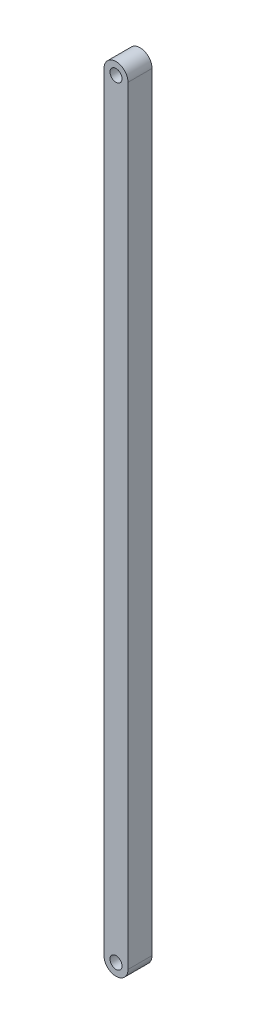
ISO-10303-21;
HEADER;
FILE_DESCRIPTION(('STEP AP214'),'2;1');
FILE_NAME('part.step','',(''),(''),'','','');
FILE_SCHEMA(('AUTOMOTIVE_DESIGN { 1 0 10303 214 1 1 1 1 }'));
ENDSEC;
DATA;
#1=APPLICATION_CONTEXT('core data for automotive mechanical design processes');
#2=APPLICATION_PROTOCOL_DEFINITION('international standard','automotive_design',2000,#1);
#3=PRODUCT_CONTEXT('',#1,'mechanical');
#4=PRODUCT('Part','Part','',(#3));
#5=PRODUCT_RELATED_PRODUCT_CATEGORY('part','',(#4));
#6=PRODUCT_DEFINITION_FORMATION('','',#4);
#7=PRODUCT_DEFINITION_CONTEXT('part definition',#1,'design');
#8=PRODUCT_DEFINITION('design','',#6,#7);
#9=PRODUCT_DEFINITION_SHAPE('','',#8);
#10=(LENGTH_UNIT() NAMED_UNIT(*) SI_UNIT(.MILLI.,.METRE.));
#11=(NAMED_UNIT(*) PLANE_ANGLE_UNIT() SI_UNIT($,.RADIAN.));
#12=(NAMED_UNIT(*) SI_UNIT($,.STERADIAN.) SOLID_ANGLE_UNIT());
#13=UNCERTAINTY_MEASURE_WITH_UNIT(LENGTH_MEASURE(1.E-05),#10,'distance_accuracy_value','');
#14=(GEOMETRIC_REPRESENTATION_CONTEXT(3) GLOBAL_UNCERTAINTY_ASSIGNED_CONTEXT((#13)) GLOBAL_UNIT_ASSIGNED_CONTEXT((#10,
#11,#12)) REPRESENTATION_CONTEXT('',''));
#15=CARTESIAN_POINT('',(0.,0.,0.));
#16=DIRECTION('',(0.,0.,1.));
#17=DIRECTION('',(1.,0.,0.));
#18=AXIS2_PLACEMENT_3D('',#15,#16,#17);
#19=CARTESIAN_POINT('',(6.35,0.,12.7));
#20=DIRECTION('',(0.,0.,1.));
#21=DIRECTION('',(1.,0.,0.));
#22=AXIS2_PLACEMENT_3D('',#19,#20,#21);
#23=PLANE('',#22);
#24=CARTESIAN_POINT('',(6.35,406.4,12.7));
#25=DIRECTION('',(0.,0.,1.));
#26=DIRECTION('',(1.,0.,0.));
#27=AXIS2_PLACEMENT_3D('',#24,#25,#26);
#28=CIRCLE('',#27,3.175);
#29=CARTESIAN_POINT('',(9.525,406.4,12.7));
#30=VERTEX_POINT('',#29);
#31=EDGE_CURVE('E100',#30,#30,#28,.T.);
#32=ORIENTED_EDGE('',*,*,#31,.F.);
#33=EDGE_LOOP('',(#32));
#34=FACE_BOUND('',#33,.T.);
#35=CARTESIAN_POINT('',(6.35,0.,12.7));
#36=DIRECTION('',(0.,0.,1.));
#37=DIRECTION('',(1.,0.,0.));
#38=AXIS2_PLACEMENT_3D('',#35,#36,#37);
#39=CIRCLE('',#38,6.35);
#40=CARTESIAN_POINT('',(0.,0.,12.7));
#41=VERTEX_POINT('',#40);
#42=CARTESIAN_POINT('',(12.7,0.,12.7));
#43=VERTEX_POINT('',#42);
#44=EDGE_CURVE('E85',#41,#43,#39,.T.);
#45=ORIENTED_EDGE('',*,*,#44,.T.);
#46=DIRECTION('',(0.,1.,0.));
#47=VECTOR('',#46,1.);
#48=CARTESIAN_POINT('',(12.7,0.,12.7));
#49=LINE('',#48,#47);
#50=CARTESIAN_POINT('',(12.7,406.4,12.7));
#51=VERTEX_POINT('',#50);
#52=EDGE_CURVE('E80',#43,#51,#49,.T.);
#53=ORIENTED_EDGE('',*,*,#52,.T.);
#54=CARTESIAN_POINT('',(6.35,406.4,12.7));
#55=DIRECTION('',(0.,0.,1.));
#56=DIRECTION('',(1.,0.,0.));
#57=AXIS2_PLACEMENT_3D('',#54,#55,#56);
#58=CIRCLE('',#57,6.35);
#59=CARTESIAN_POINT('',(0.,406.4,12.7));
#60=VERTEX_POINT('',#59);
#61=EDGE_CURVE('E83',#51,#60,#58,.T.);
#62=ORIENTED_EDGE('',*,*,#61,.T.);
#63=DIRECTION('',(0.,-1.,0.));
#64=VECTOR('',#63,1.);
#65=CARTESIAN_POINT('',(0.,0.,12.7));
#66=LINE('',#65,#64);
#67=EDGE_CURVE('E50',#60,#41,#66,.T.);
#68=ORIENTED_EDGE('',*,*,#67,.T.);
#69=EDGE_LOOP('',(#45,#53,#62,#68));
#70=FACE_BOUND('',#69,.T.);
#71=CARTESIAN_POINT('',(6.35,0.,12.7));
#72=DIRECTION('',(0.,0.,1.));
#73=DIRECTION('',(1.,0.,0.));
#74=AXIS2_PLACEMENT_3D('',#71,#72,#73);
#75=CIRCLE('',#74,3.175);
#76=CARTESIAN_POINT('',(9.525,0.,12.7));
#77=VERTEX_POINT('',#76);
#78=EDGE_CURVE('E115',#77,#77,#75,.T.);
#79=ORIENTED_EDGE('',*,*,#78,.F.);
#80=EDGE_LOOP('',(#79));
#81=FACE_BOUND('',#80,.T.);
#82=ADVANCED_FACE('F33',(#34,#70,#81),#23,.T.);
#83=CARTESIAN_POINT('',(6.35,0.,0.));
#84=DIRECTION('',(0.,0.,1.));
#85=DIRECTION('',(1.,0.,0.));
#86=AXIS2_PLACEMENT_3D('',#83,#84,#85);
#87=PLANE('',#86);
#88=CARTESIAN_POINT('',(6.35,0.,0.));
#89=DIRECTION('',(0.,0.,1.));
#90=DIRECTION('',(1.,0.,0.));
#91=AXIS2_PLACEMENT_3D('',#88,#89,#90);
#92=CIRCLE('',#91,6.35);
#93=CARTESIAN_POINT('',(0.,0.,0.));
#94=VERTEX_POINT('',#93);
#95=CARTESIAN_POINT('',(12.7,0.,0.));
#96=VERTEX_POINT('',#95);
#97=EDGE_CURVE('E97',#94,#96,#92,.T.);
#98=ORIENTED_EDGE('',*,*,#97,.F.);
#99=DIRECTION('',(0.,-1.,0.));
#100=VECTOR('',#99,1.);
#101=CARTESIAN_POINT('',(0.,0.,0.));
#102=LINE('',#101,#100);
#103=CARTESIAN_POINT('',(0.,406.4,0.));
#104=VERTEX_POINT('',#103);
#105=EDGE_CURVE('E73',#104,#94,#102,.T.);
#106=ORIENTED_EDGE('',*,*,#105,.F.);
#107=CARTESIAN_POINT('',(6.35,406.4,0.));
#108=DIRECTION('',(0.,0.,1.));
#109=DIRECTION('',(1.,0.,0.));
#110=AXIS2_PLACEMENT_3D('',#107,#108,#109);
#111=CIRCLE('',#110,6.35);
#112=CARTESIAN_POINT('',(12.7,406.4,0.));
#113=VERTEX_POINT('',#112);
#114=EDGE_CURVE('E67',#113,#104,#111,.T.);
#115=ORIENTED_EDGE('',*,*,#114,.F.);
#116=DIRECTION('',(0.,1.,0.));
#117=VECTOR('',#116,1.);
#118=CARTESIAN_POINT('',(12.7,0.,0.));
#119=LINE('',#118,#117);
#120=EDGE_CURVE('E89',#96,#113,#119,.T.);
#121=ORIENTED_EDGE('',*,*,#120,.F.);
#122=EDGE_LOOP('',(#98,#106,#115,#121));
#123=FACE_BOUND('',#122,.T.);
#124=CARTESIAN_POINT('',(6.35,406.4,0.));
#125=DIRECTION('',(0.,0.,1.));
#126=DIRECTION('',(1.,0.,0.));
#127=AXIS2_PLACEMENT_3D('',#124,#125,#126);
#128=CIRCLE('',#127,3.175);
#129=CARTESIAN_POINT('',(9.525,406.4,0.));
#130=VERTEX_POINT('',#129);
#131=EDGE_CURVE('E112',#130,#130,#128,.T.);
#132=ORIENTED_EDGE('',*,*,#131,.T.);
#133=EDGE_LOOP('',(#132));
#134=FACE_BOUND('',#133,.T.);
#135=CARTESIAN_POINT('',(6.35,0.,0.));
#136=DIRECTION('',(0.,0.,1.));
#137=DIRECTION('',(1.,0.,0.));
#138=AXIS2_PLACEMENT_3D('',#135,#136,#137);
#139=CIRCLE('',#138,3.175);
#140=CARTESIAN_POINT('',(9.525,0.,0.));
#141=VERTEX_POINT('',#140);
#142=EDGE_CURVE('E118',#141,#141,#139,.T.);
#143=ORIENTED_EDGE('',*,*,#142,.T.);
#144=EDGE_LOOP('',(#143));
#145=FACE_BOUND('',#144,.T.);
#146=ADVANCED_FACE('F108',(#123,#134,#145),#87,.F.);
#147=CARTESIAN_POINT('',(6.35,0.,12.7));
#148=DIRECTION('',(0.,0.,-1.));
#149=DIRECTION('',(-1.,0.,0.));
#150=AXIS2_PLACEMENT_3D('',#147,#148,#149);
#151=CYLINDRICAL_SURFACE('',#150,6.35);
#152=ORIENTED_EDGE('',*,*,#97,.T.);
#153=DIRECTION('',(0.,0.,-1.));
#154=VECTOR('',#153,1.);
#155=CARTESIAN_POINT('',(12.7,0.,12.7));
#156=LINE('',#155,#154);
#157=EDGE_CURVE('E11',#43,#96,#156,.T.);
#158=ORIENTED_EDGE('',*,*,#157,.F.);
#159=ORIENTED_EDGE('',*,*,#44,.F.);
#160=DIRECTION('',(0.,0.,-1.));
#161=VECTOR('',#160,1.);
#162=CARTESIAN_POINT('',(0.,0.,12.7));
#163=LINE('',#162,#161);
#164=EDGE_CURVE('E93',#41,#94,#163,.T.);
#165=ORIENTED_EDGE('',*,*,#164,.T.);
#166=EDGE_LOOP('',(#152,#158,#159,#165));
#167=FACE_BOUND('',#166,.T.);
#168=ADVANCED_FACE('F35',(#167),#151,.T.);
#169=CARTESIAN_POINT('',(12.7,0.,12.7));
#170=DIRECTION('',(-1.,0.,0.));
#171=DIRECTION('',(0.,0.,1.));
#172=AXIS2_PLACEMENT_3D('',#169,#170,#171);
#173=PLANE('',#172);
#174=ORIENTED_EDGE('',*,*,#120,.T.);
#175=DIRECTION('',(0.,0.,-1.));
#176=VECTOR('',#175,1.);
#177=CARTESIAN_POINT('',(12.7,406.4,12.7));
#178=LINE('',#177,#176);
#179=EDGE_CURVE('E42',#51,#113,#178,.T.);
#180=ORIENTED_EDGE('',*,*,#179,.F.);
#181=ORIENTED_EDGE('',*,*,#52,.F.);
#182=ORIENTED_EDGE('',*,*,#157,.T.);
#183=EDGE_LOOP('',(#174,#180,#181,#182));
#184=FACE_BOUND('',#183,.T.);
#185=ADVANCED_FACE('F88',(#184),#173,.F.);
#186=CARTESIAN_POINT('',(6.35,406.4,12.7));
#187=DIRECTION('',(0.,0.,-1.));
#188=DIRECTION('',(-1.,0.,0.));
#189=AXIS2_PLACEMENT_3D('',#186,#187,#188);
#190=CYLINDRICAL_SURFACE('',#189,6.35);
#191=ORIENTED_EDGE('',*,*,#114,.T.);
#192=DIRECTION('',(0.,0.,-1.));
#193=VECTOR('',#192,1.);
#194=CARTESIAN_POINT('',(0.,406.4,12.7));
#195=LINE('',#194,#193);
#196=EDGE_CURVE('E90',#60,#104,#195,.T.);
#197=ORIENTED_EDGE('',*,*,#196,.F.);
#198=ORIENTED_EDGE('',*,*,#61,.F.);
#199=ORIENTED_EDGE('',*,*,#179,.T.);
#200=EDGE_LOOP('',(#191,#197,#198,#199));
#201=FACE_BOUND('',#200,.T.);
#202=ADVANCED_FACE('F91',(#201),#190,.T.);
#203=CARTESIAN_POINT('',(0.,0.,12.7));
#204=DIRECTION('',(1.,0.,0.));
#205=DIRECTION('',(0.,0.,-1.));
#206=AXIS2_PLACEMENT_3D('',#203,#204,#205);
#207=PLANE('',#206);
#208=ORIENTED_EDGE('',*,*,#105,.T.);
#209=ORIENTED_EDGE('',*,*,#164,.F.);
#210=ORIENTED_EDGE('',*,*,#67,.F.);
#211=ORIENTED_EDGE('',*,*,#196,.T.);
#212=EDGE_LOOP('',(#208,#209,#210,#211));
#213=FACE_BOUND('',#212,.T.);
#214=ADVANCED_FACE('F105',(#213),#207,.F.);
#215=CARTESIAN_POINT('',(6.35,406.4,12.7));
#216=DIRECTION('',(0.,0.,-1.));
#217=DIRECTION('',(-1.,0.,0.));
#218=AXIS2_PLACEMENT_3D('',#215,#216,#217);
#219=CYLINDRICAL_SURFACE('',#218,3.175);
#220=ORIENTED_EDGE('',*,*,#31,.T.);
#221=EDGE_LOOP('',(#220));
#222=FACE_BOUND('',#221,.T.);
#223=ORIENTED_EDGE('',*,*,#131,.F.);
#224=EDGE_LOOP('',(#223));
#225=FACE_BOUND('',#224,.T.);
#226=ADVANCED_FACE('F135',(#222,#225),#219,.F.);
#227=CARTESIAN_POINT('',(6.35,0.,12.7));
#228=DIRECTION('',(0.,0.,-1.));
#229=DIRECTION('',(-1.,0.,0.));
#230=AXIS2_PLACEMENT_3D('',#227,#228,#229);
#231=CYLINDRICAL_SURFACE('',#230,3.175);
#232=ORIENTED_EDGE('',*,*,#78,.T.);
#233=EDGE_LOOP('',(#232));
#234=FACE_BOUND('',#233,.T.);
#235=ORIENTED_EDGE('',*,*,#142,.F.);
#236=EDGE_LOOP('',(#235));
#237=FACE_BOUND('',#236,.T.);
#238=ADVANCED_FACE('F124',(#234,#237),#231,.F.);
#239=CLOSED_SHELL('',(#82,#146,#168,#185,#202,#214,#226,#238));
#240=MANIFOLD_SOLID_BREP('B2',#239);
#241=ADVANCED_BREP_SHAPE_REPRESENTATION('',(#18,#240),#14);
#242=SHAPE_DEFINITION_REPRESENTATION(#9,#241);
ENDSEC;
END-ISO-10303-21;
